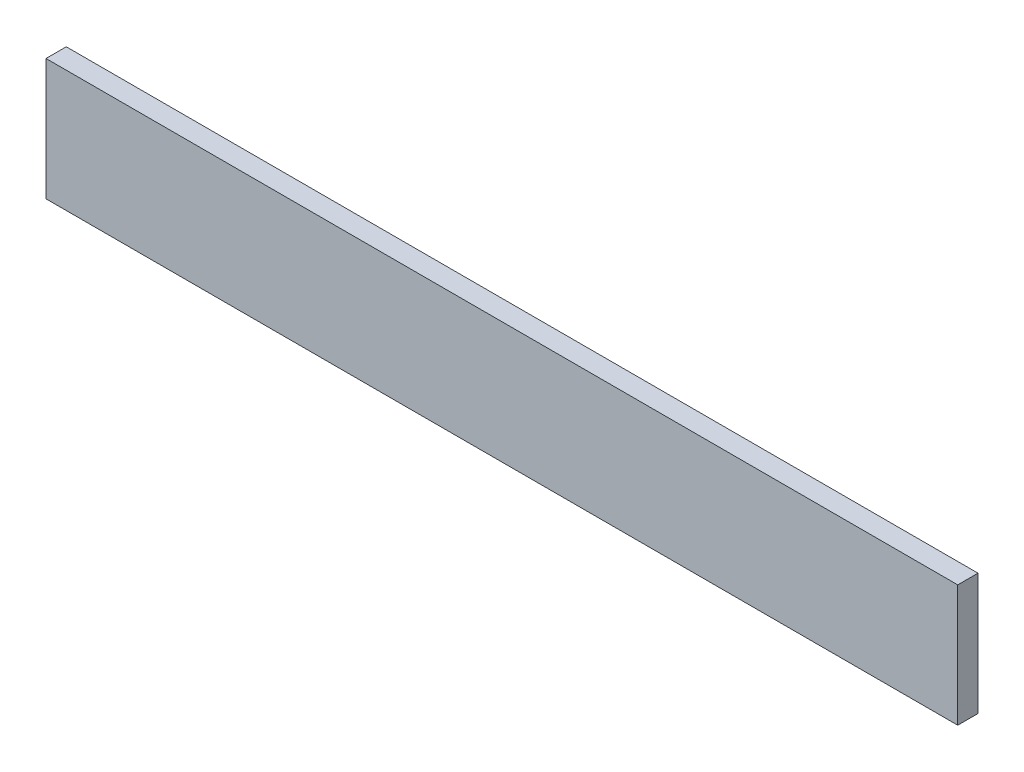
ISO-10303-21;
HEADER;
FILE_DESCRIPTION(('STEP AP214'),'2;1');
FILE_NAME('part.step','',(''),(''),'','','');
FILE_SCHEMA(('AUTOMOTIVE_DESIGN { 1 0 10303 214 1 1 1 1 }'));
ENDSEC;
DATA;
#1=APPLICATION_CONTEXT('core data for automotive mechanical design processes');
#2=APPLICATION_PROTOCOL_DEFINITION('international standard','automotive_design',2000,#1);
#3=PRODUCT_CONTEXT('',#1,'mechanical');
#4=PRODUCT('Part','Part','',(#3));
#5=PRODUCT_RELATED_PRODUCT_CATEGORY('part','',(#4));
#6=PRODUCT_DEFINITION_FORMATION('','',#4);
#7=PRODUCT_DEFINITION_CONTEXT('part definition',#1,'design');
#8=PRODUCT_DEFINITION('design','',#6,#7);
#9=PRODUCT_DEFINITION_SHAPE('','',#8);
#10=(LENGTH_UNIT() NAMED_UNIT(*) SI_UNIT(.MILLI.,.METRE.));
#11=(NAMED_UNIT(*) PLANE_ANGLE_UNIT() SI_UNIT($,.RADIAN.));
#12=(NAMED_UNIT(*) SI_UNIT($,.STERADIAN.) SOLID_ANGLE_UNIT());
#13=UNCERTAINTY_MEASURE_WITH_UNIT(LENGTH_MEASURE(1.E-05),#10,'distance_accuracy_value','');
#14=(GEOMETRIC_REPRESENTATION_CONTEXT(3) GLOBAL_UNCERTAINTY_ASSIGNED_CONTEXT((#13)) GLOBAL_UNIT_ASSIGNED_CONTEXT((#10,
#11,#12)) REPRESENTATION_CONTEXT('',''));
#15=CARTESIAN_POINT('',(0.,0.,0.));
#16=DIRECTION('',(0.,0.,1.));
#17=DIRECTION('',(1.,0.,0.));
#18=AXIS2_PLACEMENT_3D('',#15,#16,#17);
#19=CARTESIAN_POINT('',(0.5715,0.0762,0.0254));
#20=DIRECTION('',(0.,0.,1.));
#21=DIRECTION('',(1.,0.,0.));
#22=AXIS2_PLACEMENT_3D('',#19,#20,#21);
#23=PLANE('',#22);
#24=DIRECTION('',(1.,0.,0.));
#25=VECTOR('',#24,1.);
#26=CARTESIAN_POINT('',(0.5715,-0.0762,0.0254));
#27=LINE('',#26,#25);
#28=CARTESIAN_POINT('',(0.5715,-0.0762,0.0254));
#29=VERTEX_POINT('',#28);
#30=CARTESIAN_POINT('',(-0.5715,-0.0762,0.0254));
#31=VERTEX_POINT('',#30);
#32=EDGE_CURVE('E53',#29,#31,#27,.F.);
#33=ORIENTED_EDGE('',*,*,#32,.F.);
#34=DIRECTION('',(0.,1.,0.));
#35=VECTOR('',#34,1.);
#36=CARTESIAN_POINT('',(0.5715,0.0762,0.0254));
#37=LINE('',#36,#35);
#38=CARTESIAN_POINT('',(0.5715,0.0762,0.0254));
#39=VERTEX_POINT('',#38);
#40=EDGE_CURVE('E68',#39,#29,#37,.F.);
#41=ORIENTED_EDGE('',*,*,#40,.F.);
#42=DIRECTION('',(1.,0.,0.));
#43=VECTOR('',#42,1.);
#44=CARTESIAN_POINT('',(-0.5715,0.0762,0.0254));
#45=LINE('',#44,#43);
#46=CARTESIAN_POINT('',(-0.5715,0.0762,0.0254));
#47=VERTEX_POINT('',#46);
#48=EDGE_CURVE('E20',#47,#39,#45,.T.);
#49=ORIENTED_EDGE('',*,*,#48,.F.);
#50=DIRECTION('',(0.,1.,0.));
#51=VECTOR('',#50,1.);
#52=CARTESIAN_POINT('',(-0.5715,-0.0762,0.0254));
#53=LINE('',#52,#51);
#54=EDGE_CURVE('E58',#31,#47,#53,.T.);
#55=ORIENTED_EDGE('',*,*,#54,.F.);
#56=EDGE_LOOP('',(#33,#41,#49,#55));
#57=FACE_BOUND('',#56,.T.);
#58=ADVANCED_FACE('F17',(#57),#23,.T.);
#59=CARTESIAN_POINT('',(-0.5715,0.0762,0.));
#60=DIRECTION('',(0.,1.,0.));
#61=DIRECTION('',(0.,0.,1.));
#62=AXIS2_PLACEMENT_3D('',#59,#60,#61);
#63=PLANE('',#62);
#64=DIRECTION('',(0.,0.,-1.));
#65=VECTOR('',#64,1.);
#66=CARTESIAN_POINT('',(0.5715,0.0762,0.));
#67=LINE('',#66,#65);
#68=CARTESIAN_POINT('',(0.5715,0.0762,0.));
#69=VERTEX_POINT('',#68);
#70=EDGE_CURVE('E79',#69,#39,#67,.F.);
#71=ORIENTED_EDGE('',*,*,#70,.F.);
#72=DIRECTION('',(1.,0.,0.));
#73=VECTOR('',#72,1.);
#74=CARTESIAN_POINT('',(0.5715,0.0762,0.));
#75=LINE('',#74,#73);
#76=CARTESIAN_POINT('',(-0.5715,0.0762,0.));
#77=VERTEX_POINT('',#76);
#78=EDGE_CURVE('E74',#69,#77,#75,.F.);
#79=ORIENTED_EDGE('',*,*,#78,.T.);
#80=DIRECTION('',(0.,0.,1.));
#81=VECTOR('',#80,1.);
#82=CARTESIAN_POINT('',(-0.5715,0.0762,0.));
#83=LINE('',#82,#81);
#84=EDGE_CURVE('E63',#47,#77,#83,.F.);
#85=ORIENTED_EDGE('',*,*,#84,.F.);
#86=ORIENTED_EDGE('',*,*,#48,.T.);
#87=EDGE_LOOP('',(#71,#79,#85,#86));
#88=FACE_BOUND('',#87,.T.);
#89=ADVANCED_FACE('F73',(#88),#63,.T.);
#90=CARTESIAN_POINT('',(-0.5715,-0.0762,0.));
#91=DIRECTION('',(-1.,0.,0.));
#92=DIRECTION('',(0.,0.,1.));
#93=AXIS2_PLACEMENT_3D('',#90,#91,#92);
#94=PLANE('',#93);
#95=ORIENTED_EDGE('',*,*,#84,.T.);
#96=DIRECTION('',(0.,1.,0.));
#97=VECTOR('',#96,1.);
#98=CARTESIAN_POINT('',(-0.5715,0.0762,0.));
#99=LINE('',#98,#97);
#100=CARTESIAN_POINT('',(-0.5715,-0.0762,0.));
#101=VERTEX_POINT('',#100);
#102=EDGE_CURVE('E84',#77,#101,#99,.F.);
#103=ORIENTED_EDGE('',*,*,#102,.T.);
#104=DIRECTION('',(0.,0.,-1.));
#105=VECTOR('',#104,1.);
#106=CARTESIAN_POINT('',(-0.5715,-0.0762,0.));
#107=LINE('',#106,#105);
#108=EDGE_CURVE('E65',#31,#101,#107,.T.);
#109=ORIENTED_EDGE('',*,*,#108,.F.);
#110=ORIENTED_EDGE('',*,*,#54,.T.);
#111=EDGE_LOOP('',(#95,#103,#109,#110));
#112=FACE_BOUND('',#111,.T.);
#113=ADVANCED_FACE('F60',(#112),#94,.T.);
#114=CARTESIAN_POINT('',(0.5715,-0.0762,0.));
#115=DIRECTION('',(0.,-1.,0.));
#116=DIRECTION('',(0.,0.,-1.));
#117=AXIS2_PLACEMENT_3D('',#114,#115,#116);
#118=PLANE('',#117);
#119=ORIENTED_EDGE('',*,*,#108,.T.);
#120=DIRECTION('',(1.,0.,0.));
#121=VECTOR('',#120,1.);
#122=CARTESIAN_POINT('',(0.5715,-0.0762,0.));
#123=LINE('',#122,#121);
#124=CARTESIAN_POINT('',(0.5715,-0.0762,0.));
#125=VERTEX_POINT('',#124);
#126=EDGE_CURVE('E26',#101,#125,#123,.T.);
#127=ORIENTED_EDGE('',*,*,#126,.T.);
#128=DIRECTION('',(0.,0.,-1.));
#129=VECTOR('',#128,1.);
#130=CARTESIAN_POINT('',(0.5715,-0.0762,0.));
#131=LINE('',#130,#129);
#132=EDGE_CURVE('E34',#29,#125,#131,.T.);
#133=ORIENTED_EDGE('',*,*,#132,.F.);
#134=ORIENTED_EDGE('',*,*,#32,.T.);
#135=EDGE_LOOP('',(#119,#127,#133,#134));
#136=FACE_BOUND('',#135,.T.);
#137=ADVANCED_FACE('F88',(#136),#118,.T.);
#138=CARTESIAN_POINT('',(0.5715,0.0762,0.));
#139=DIRECTION('',(1.,0.,0.));
#140=DIRECTION('',(0.,0.,-1.));
#141=AXIS2_PLACEMENT_3D('',#138,#139,#140);
#142=PLANE('',#141);
#143=ORIENTED_EDGE('',*,*,#132,.T.);
#144=DIRECTION('',(0.,1.,0.));
#145=VECTOR('',#144,1.);
#146=CARTESIAN_POINT('',(0.5715,0.0762,0.));
#147=LINE('',#146,#145);
#148=EDGE_CURVE('E11',#125,#69,#147,.T.);
#149=ORIENTED_EDGE('',*,*,#148,.T.);
#150=ORIENTED_EDGE('',*,*,#70,.T.);
#151=ORIENTED_EDGE('',*,*,#40,.T.);
#152=EDGE_LOOP('',(#143,#149,#150,#151));
#153=FACE_BOUND('',#152,.T.);
#154=ADVANCED_FACE('F91',(#153),#142,.T.);
#155=CARTESIAN_POINT('',(0.5715,0.0762,0.));
#156=DIRECTION('',(0.,0.,1.));
#157=DIRECTION('',(1.,0.,0.));
#158=AXIS2_PLACEMENT_3D('',#155,#156,#157);
#159=PLANE('',#158);
#160=ORIENTED_EDGE('',*,*,#126,.F.);
#161=ORIENTED_EDGE('',*,*,#102,.F.);
#162=ORIENTED_EDGE('',*,*,#78,.F.);
#163=ORIENTED_EDGE('',*,*,#148,.F.);
#164=EDGE_LOOP('',(#160,#161,#162,#163));
#165=FACE_BOUND('',#164,.T.);
#166=ADVANCED_FACE('F90',(#165),#159,.F.);
#167=CLOSED_SHELL('',(#58,#89,#113,#137,#154,#166));
#168=MANIFOLD_SOLID_BREP('B1',#167);
#169=ADVANCED_BREP_SHAPE_REPRESENTATION('',(#18,#168),#14);
#170=SHAPE_DEFINITION_REPRESENTATION(#9,#169);
ENDSEC;
END-ISO-10303-21;
